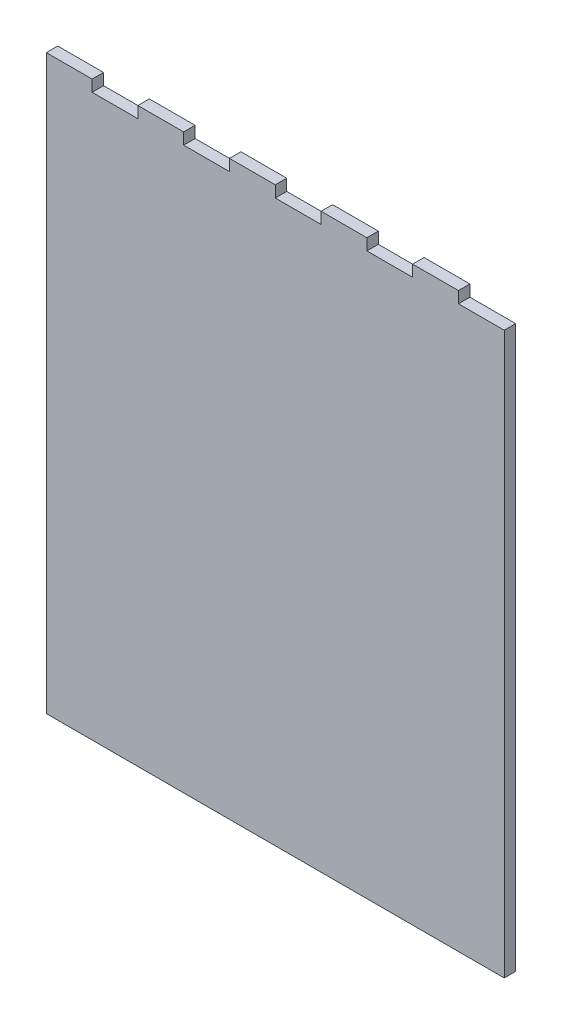
ISO-10303-21;
HEADER;
FILE_DESCRIPTION(('STEP AP214'),'2;1');
FILE_NAME('part.step','',(''),(''),'','','');
FILE_SCHEMA(('AUTOMOTIVE_DESIGN { 1 0 10303 214 1 1 1 1 }'));
ENDSEC;
DATA;
#1=APPLICATION_CONTEXT('core data for automotive mechanical design processes');
#2=APPLICATION_PROTOCOL_DEFINITION('international standard','automotive_design',2000,#1);
#3=PRODUCT_CONTEXT('',#1,'mechanical');
#4=PRODUCT('Part','Part','',(#3));
#5=PRODUCT_RELATED_PRODUCT_CATEGORY('part','',(#4));
#6=PRODUCT_DEFINITION_FORMATION('','',#4);
#7=PRODUCT_DEFINITION_CONTEXT('part definition',#1,'design');
#8=PRODUCT_DEFINITION('design','',#6,#7);
#9=PRODUCT_DEFINITION_SHAPE('','',#8);
#10=(LENGTH_UNIT() NAMED_UNIT(*) SI_UNIT(.MILLI.,.METRE.));
#11=(NAMED_UNIT(*) PLANE_ANGLE_UNIT() SI_UNIT($,.RADIAN.));
#12=(NAMED_UNIT(*) SI_UNIT($,.STERADIAN.) SOLID_ANGLE_UNIT());
#13=UNCERTAINTY_MEASURE_WITH_UNIT(LENGTH_MEASURE(1.E-05),#10,'distance_accuracy_value','');
#14=(GEOMETRIC_REPRESENTATION_CONTEXT(3) GLOBAL_UNCERTAINTY_ASSIGNED_CONTEXT((#13)) GLOBAL_UNIT_ASSIGNED_CONTEXT((#10,
#11,#12)) REPRESENTATION_CONTEXT('',''));
#15=CARTESIAN_POINT('',(0.,0.,0.));
#16=DIRECTION('',(0.,0.,1.));
#17=DIRECTION('',(1.,0.,0.));
#18=AXIS2_PLACEMENT_3D('',#15,#16,#17);
#19=CARTESIAN_POINT('',(0.,317.5,6.35));
#20=DIRECTION('',(0.,-1.,0.));
#21=DIRECTION('',(0.,0.,-1.));
#22=AXIS2_PLACEMENT_3D('',#19,#20,#21);
#23=PLANE('',#22);
#24=DIRECTION('',(0.,0.,-1.));
#25=VECTOR('',#24,1.);
#26=CARTESIAN_POINT('',(76.2,317.5,6.35));
#27=LINE('',#26,#25);
#28=CARTESIAN_POINT('',(76.2,317.5,6.35));
#29=VERTEX_POINT('',#28);
#30=CARTESIAN_POINT('',(76.2,317.5,0.));
#31=VERTEX_POINT('',#30);
#32=EDGE_CURVE('E197',#29,#31,#27,.T.);
#33=ORIENTED_EDGE('',*,*,#32,.T.);
#34=DIRECTION('',(-1.,0.,0.));
#35=VECTOR('',#34,1.);
#36=CARTESIAN_POINT('',(0.,317.5,0.));
#37=LINE('',#36,#35);
#38=CARTESIAN_POINT('',(50.8,317.5,0.));
#39=VERTEX_POINT('',#38);
#40=EDGE_CURVE('E394',#31,#39,#37,.T.);
#41=ORIENTED_EDGE('',*,*,#40,.T.);
#42=DIRECTION('',(0.,0.,-1.));
#43=VECTOR('',#42,1.);
#44=CARTESIAN_POINT('',(50.8,317.5,6.35));
#45=LINE('',#44,#43);
#46=CARTESIAN_POINT('',(50.8,317.5,6.35));
#47=VERTEX_POINT('',#46);
#48=EDGE_CURVE('E354',#47,#39,#45,.T.);
#49=ORIENTED_EDGE('',*,*,#48,.F.);
#50=DIRECTION('',(-1.,0.,0.));
#51=VECTOR('',#50,1.);
#52=CARTESIAN_POINT('',(0.,317.5,6.35));
#53=LINE('',#52,#51);
#54=EDGE_CURVE('E379',#29,#47,#53,.T.);
#55=ORIENTED_EDGE('',*,*,#54,.F.);
#56=EDGE_LOOP('',(#33,#41,#49,#55));
#57=FACE_BOUND('',#56,.T.);
#58=ADVANCED_FACE('F39',(#57),#23,.F.);
#59=DIRECTION('',(0.,0.,-1.));
#60=VECTOR('',#59,1.);
#61=CARTESIAN_POINT('',(101.6,317.5,6.35));
#62=LINE('',#61,#60);
#63=CARTESIAN_POINT('',(101.6,317.5,6.35));
#64=VERTEX_POINT('',#63);
#65=CARTESIAN_POINT('',(101.6,317.5,0.));
#66=VERTEX_POINT('',#65);
#67=EDGE_CURVE('E55',#64,#66,#62,.T.);
#68=ORIENTED_EDGE('',*,*,#67,.F.);
#69=CARTESIAN_POINT('',(127.,317.5,6.35));
#70=VERTEX_POINT('',#69);
#71=EDGE_CURVE('E382',#70,#64,#53,.T.);
#72=ORIENTED_EDGE('',*,*,#71,.F.);
#73=DIRECTION('',(0.,0.,-1.));
#74=VECTOR('',#73,1.);
#75=CARTESIAN_POINT('',(127.,317.5,6.35));
#76=LINE('',#75,#74);
#77=CARTESIAN_POINT('',(127.,317.5,0.));
#78=VERTEX_POINT('',#77);
#79=EDGE_CURVE('E247',#70,#78,#76,.T.);
#80=ORIENTED_EDGE('',*,*,#79,.T.);
#81=EDGE_CURVE('E397',#78,#66,#37,.T.);
#82=ORIENTED_EDGE('',*,*,#81,.T.);
#83=EDGE_LOOP('',(#68,#72,#80,#82));
#84=FACE_BOUND('',#83,.T.);
#85=ADVANCED_FACE('F457',(#84),#23,.F.);
#86=DIRECTION('',(0.,0.,-1.));
#87=VECTOR('',#86,1.);
#88=CARTESIAN_POINT('',(152.4,317.5,6.35));
#89=LINE('',#88,#87);
#90=CARTESIAN_POINT('',(152.4,317.5,6.35));
#91=VERTEX_POINT('',#90);
#92=CARTESIAN_POINT('',(152.4,317.5,0.));
#93=VERTEX_POINT('',#92);
#94=EDGE_CURVE('E63',#91,#93,#89,.T.);
#95=ORIENTED_EDGE('',*,*,#94,.F.);
#96=CARTESIAN_POINT('',(177.8,317.5,6.35));
#97=VERTEX_POINT('',#96);
#98=EDGE_CURVE('E431',#97,#91,#53,.T.);
#99=ORIENTED_EDGE('',*,*,#98,.F.);
#100=DIRECTION('',(0.,0.,-1.));
#101=VECTOR('',#100,1.);
#102=CARTESIAN_POINT('',(177.8,317.5,6.35));
#103=LINE('',#102,#101);
#104=CARTESIAN_POINT('',(177.8,317.5,0.));
#105=VERTEX_POINT('',#104);
#106=EDGE_CURVE('E280',#97,#105,#103,.T.);
#107=ORIENTED_EDGE('',*,*,#106,.T.);
#108=EDGE_CURVE('E482',#105,#93,#37,.T.);
#109=ORIENTED_EDGE('',*,*,#108,.T.);
#110=EDGE_LOOP('',(#95,#99,#107,#109));
#111=FACE_BOUND('',#110,.T.);
#112=ADVANCED_FACE('F463',(#111),#23,.F.);
#113=DIRECTION('',(0.,0.,-1.));
#114=VECTOR('',#113,1.);
#115=CARTESIAN_POINT('',(203.2,317.5,6.35));
#116=LINE('',#115,#114);
#117=CARTESIAN_POINT('',(203.2,317.5,6.35));
#118=VERTEX_POINT('',#117);
#119=CARTESIAN_POINT('',(203.2,317.5,0.));
#120=VERTEX_POINT('',#119);
#121=EDGE_CURVE('E296',#118,#120,#116,.T.);
#122=ORIENTED_EDGE('',*,*,#121,.F.);
#123=CARTESIAN_POINT('',(228.6,317.5,6.35));
#124=VERTEX_POINT('',#123);
#125=EDGE_CURVE('E401',#124,#118,#53,.T.);
#126=ORIENTED_EDGE('',*,*,#125,.F.);
#127=DIRECTION('',(0.,0.,-1.));
#128=VECTOR('',#127,1.);
#129=CARTESIAN_POINT('',(228.6,317.5,6.35));
#130=LINE('',#129,#128);
#131=CARTESIAN_POINT('',(228.6,317.5,0.));
#132=VERTEX_POINT('',#131);
#133=EDGE_CURVE('E312',#124,#132,#130,.T.);
#134=ORIENTED_EDGE('',*,*,#133,.T.);
#135=EDGE_CURVE('E371',#132,#120,#37,.T.);
#136=ORIENTED_EDGE('',*,*,#135,.T.);
#137=EDGE_LOOP('',(#122,#126,#134,#136));
#138=FACE_BOUND('',#137,.T.);
#139=ADVANCED_FACE('F428',(#138),#23,.F.);
#140=CARTESIAN_POINT('',(0.,0.,6.35));
#141=DIRECTION('',(0.,0.,-1.));
#142=DIRECTION('',(-1.,0.,0.));
#143=AXIS2_PLACEMENT_3D('',#140,#141,#142);
#144=PLANE('',#143);
#145=DIRECTION('',(0.,-1.,0.));
#146=VECTOR('',#145,1.);
#147=CARTESIAN_POINT('',(76.2,317.5,6.35));
#148=LINE('',#147,#146);
#149=CARTESIAN_POINT('',(76.2,311.15,6.35));
#150=VERTEX_POINT('',#149);
#151=EDGE_CURVE('E191',#29,#150,#148,.T.);
#152=ORIENTED_EDGE('',*,*,#151,.F.);
#153=ORIENTED_EDGE('',*,*,#54,.T.);
#154=DIRECTION('',(0.,1.,0.));
#155=VECTOR('',#154,1.);
#156=CARTESIAN_POINT('',(50.8,317.5,6.35));
#157=LINE('',#156,#155);
#158=CARTESIAN_POINT('',(50.8,311.15,6.35));
#159=VERTEX_POINT('',#158);
#160=EDGE_CURVE('E336',#159,#47,#157,.T.);
#161=ORIENTED_EDGE('',*,*,#160,.F.);
#162=DIRECTION('',(1.,0.,0.));
#163=VECTOR('',#162,1.);
#164=CARTESIAN_POINT('',(25.4,311.15,6.35));
#165=LINE('',#164,#163);
#166=CARTESIAN_POINT('',(25.4,311.15,6.35));
#167=VERTEX_POINT('',#166);
#168=EDGE_CURVE('E332',#167,#159,#165,.T.);
#169=ORIENTED_EDGE('',*,*,#168,.F.);
#170=DIRECTION('',(0.,-1.,0.));
#171=VECTOR('',#170,1.);
#172=CARTESIAN_POINT('',(25.4,317.5,6.35));
#173=LINE('',#172,#171);
#174=CARTESIAN_POINT('',(25.4,317.5,6.35));
#175=VERTEX_POINT('',#174);
#176=EDGE_CURVE('E329',#175,#167,#173,.T.);
#177=ORIENTED_EDGE('',*,*,#176,.F.);
#178=CARTESIAN_POINT('',(0.,317.5,6.35));
#179=VERTEX_POINT('',#178);
#180=EDGE_CURVE('E378',#175,#179,#53,.T.);
#181=ORIENTED_EDGE('',*,*,#180,.T.);
#182=DIRECTION('',(0.,-1.,0.));
#183=VECTOR('',#182,1.);
#184=CARTESIAN_POINT('',(0.,0.,6.35));
#185=LINE('',#184,#183);
#186=CARTESIAN_POINT('',(0.,0.,6.35));
#187=VERTEX_POINT('',#186);
#188=EDGE_CURVE('E366',#179,#187,#185,.T.);
#189=ORIENTED_EDGE('',*,*,#188,.T.);
#190=DIRECTION('',(1.,0.,0.));
#191=VECTOR('',#190,1.);
#192=CARTESIAN_POINT('',(0.,0.,6.35));
#193=LINE('',#192,#191);
#194=CARTESIAN_POINT('',(254.,0.,6.35));
#195=VERTEX_POINT('',#194);
#196=EDGE_CURVE('E370',#187,#195,#193,.T.);
#197=ORIENTED_EDGE('',*,*,#196,.T.);
#198=DIRECTION('',(0.,1.,0.));
#199=VECTOR('',#198,1.);
#200=CARTESIAN_POINT('',(254.,0.,6.35));
#201=LINE('',#200,#199);
#202=CARTESIAN_POINT('',(254.,311.15,6.35));
#203=VERTEX_POINT('',#202);
#204=EDGE_CURVE('E374',#195,#203,#201,.T.);
#205=ORIENTED_EDGE('',*,*,#204,.T.);
#206=DIRECTION('',(1.,0.,0.));
#207=VECTOR('',#206,1.);
#208=CARTESIAN_POINT('',(228.6,311.15,6.35));
#209=LINE('',#208,#207);
#210=CARTESIAN_POINT('',(228.6,311.15,6.35));
#211=VERTEX_POINT('',#210);
#212=EDGE_CURVE('E308',#211,#203,#209,.T.);
#213=ORIENTED_EDGE('',*,*,#212,.F.);
#214=DIRECTION('',(0.,-1.,0.));
#215=VECTOR('',#214,1.);
#216=CARTESIAN_POINT('',(228.6,317.5,6.35));
#217=LINE('',#216,#215);
#218=EDGE_CURVE('E305',#124,#211,#217,.T.);
#219=ORIENTED_EDGE('',*,*,#218,.F.);
#220=ORIENTED_EDGE('',*,*,#125,.T.);
#221=DIRECTION('',(0.,1.,0.));
#222=VECTOR('',#221,1.);
#223=CARTESIAN_POINT('',(203.2,317.5,6.35));
#224=LINE('',#223,#222);
#225=CARTESIAN_POINT('',(203.2,311.15,6.35));
#226=VERTEX_POINT('',#225);
#227=EDGE_CURVE('E277',#226,#118,#224,.T.);
#228=ORIENTED_EDGE('',*,*,#227,.F.);
#229=DIRECTION('',(1.,0.,0.));
#230=VECTOR('',#229,1.);
#231=CARTESIAN_POINT('',(177.8,311.15,6.35));
#232=LINE('',#231,#230);
#233=CARTESIAN_POINT('',(177.8,311.15,6.35));
#234=VERTEX_POINT('',#233);
#235=EDGE_CURVE('E273',#234,#226,#232,.T.);
#236=ORIENTED_EDGE('',*,*,#235,.F.);
#237=DIRECTION('',(0.,-1.,0.));
#238=VECTOR('',#237,1.);
#239=CARTESIAN_POINT('',(177.8,317.5,6.35));
#240=LINE('',#239,#238);
#241=EDGE_CURVE('E270',#97,#234,#240,.T.);
#242=ORIENTED_EDGE('',*,*,#241,.F.);
#243=ORIENTED_EDGE('',*,*,#98,.T.);
#244=DIRECTION('',(0.,1.,0.));
#245=VECTOR('',#244,1.);
#246=CARTESIAN_POINT('',(152.4,317.5,6.35));
#247=LINE('',#246,#245);
#248=CARTESIAN_POINT('',(152.4,311.15,6.35));
#249=VERTEX_POINT('',#248);
#250=EDGE_CURVE('E244',#249,#91,#247,.T.);
#251=ORIENTED_EDGE('',*,*,#250,.F.);
#252=DIRECTION('',(1.,0.,0.));
#253=VECTOR('',#252,1.);
#254=CARTESIAN_POINT('',(127.,311.15,6.35));
#255=LINE('',#254,#253);
#256=CARTESIAN_POINT('',(127.,311.15,6.35));
#257=VERTEX_POINT('',#256);
#258=EDGE_CURVE('E240',#257,#249,#255,.T.);
#259=ORIENTED_EDGE('',*,*,#258,.F.);
#260=DIRECTION('',(0.,-1.,0.));
#261=VECTOR('',#260,1.);
#262=CARTESIAN_POINT('',(127.,317.5,6.35));
#263=LINE('',#262,#261);
#264=EDGE_CURVE('E237',#70,#257,#263,.T.);
#265=ORIENTED_EDGE('',*,*,#264,.F.);
#266=ORIENTED_EDGE('',*,*,#71,.T.);
#267=DIRECTION('',(0.,1.,0.));
#268=VECTOR('',#267,1.);
#269=CARTESIAN_POINT('',(101.6,317.5,6.35));
#270=LINE('',#269,#268);
#271=CARTESIAN_POINT('',(101.6,311.15,6.35));
#272=VERTEX_POINT('',#271);
#273=EDGE_CURVE('E217',#272,#64,#270,.T.);
#274=ORIENTED_EDGE('',*,*,#273,.F.);
#275=DIRECTION('',(1.,0.,0.));
#276=VECTOR('',#275,1.);
#277=CARTESIAN_POINT('',(76.2,311.15,6.35));
#278=LINE('',#277,#276);
#279=EDGE_CURVE('E202',#150,#272,#278,.T.);
#280=ORIENTED_EDGE('',*,*,#279,.F.);
#281=EDGE_LOOP('',(#152,#153,#161,#169,#177,#181,#189,#197,#205,#213,#219,#220,#228,#236,#242,
#243,#251,#259,#265,#266,#274,#280));
#282=FACE_BOUND('',#281,.T.);
#283=ADVANCED_FACE('F215',(#282),#144,.F.);
#284=CARTESIAN_POINT('',(0.,0.,0.));
#285=DIRECTION('',(0.,0.,-1.));
#286=DIRECTION('',(-1.,0.,0.));
#287=AXIS2_PLACEMENT_3D('',#284,#285,#286);
#288=PLANE('',#287);
#289=ORIENTED_EDGE('',*,*,#40,.F.);
#290=DIRECTION('',(0.,-1.,0.));
#291=VECTOR('',#290,1.);
#292=CARTESIAN_POINT('',(76.2,317.5,0.));
#293=LINE('',#292,#291);
#294=CARTESIAN_POINT('',(76.2,311.15,0.));
#295=VERTEX_POINT('',#294);
#296=EDGE_CURVE('E223',#31,#295,#293,.T.);
#297=ORIENTED_EDGE('',*,*,#296,.T.);
#298=DIRECTION('',(1.,0.,0.));
#299=VECTOR('',#298,1.);
#300=CARTESIAN_POINT('',(76.2,311.15,0.));
#301=LINE('',#300,#299);
#302=CARTESIAN_POINT('',(101.6,311.15,0.));
#303=VERTEX_POINT('',#302);
#304=EDGE_CURVE('E209',#295,#303,#301,.T.);
#305=ORIENTED_EDGE('',*,*,#304,.T.);
#306=DIRECTION('',(0.,1.,0.));
#307=VECTOR('',#306,1.);
#308=CARTESIAN_POINT('',(101.6,317.5,0.));
#309=LINE('',#308,#307);
#310=EDGE_CURVE('E203',#303,#66,#309,.T.);
#311=ORIENTED_EDGE('',*,*,#310,.T.);
#312=ORIENTED_EDGE('',*,*,#81,.F.);
#313=DIRECTION('',(0.,-1.,0.));
#314=VECTOR('',#313,1.);
#315=CARTESIAN_POINT('',(127.,317.5,0.));
#316=LINE('',#315,#314);
#317=CARTESIAN_POINT('',(127.,311.15,0.));
#318=VERTEX_POINT('',#317);
#319=EDGE_CURVE('E248',#78,#318,#316,.T.);
#320=ORIENTED_EDGE('',*,*,#319,.T.);
#321=DIRECTION('',(1.,0.,0.));
#322=VECTOR('',#321,1.);
#323=CARTESIAN_POINT('',(127.,311.15,0.));
#324=LINE('',#323,#322);
#325=CARTESIAN_POINT('',(152.4,311.15,0.));
#326=VERTEX_POINT('',#325);
#327=EDGE_CURVE('E252',#318,#326,#324,.T.);
#328=ORIENTED_EDGE('',*,*,#327,.T.);
#329=DIRECTION('',(0.,1.,0.));
#330=VECTOR('',#329,1.);
#331=CARTESIAN_POINT('',(152.4,317.5,0.));
#332=LINE('',#331,#330);
#333=EDGE_CURVE('E241',#326,#93,#332,.T.);
#334=ORIENTED_EDGE('',*,*,#333,.T.);
#335=ORIENTED_EDGE('',*,*,#108,.F.);
#336=DIRECTION('',(0.,-1.,0.));
#337=VECTOR('',#336,1.);
#338=CARTESIAN_POINT('',(177.8,317.5,0.));
#339=LINE('',#338,#337);
#340=CARTESIAN_POINT('',(177.8,311.15,0.));
#341=VERTEX_POINT('',#340);
#342=EDGE_CURVE('E281',#105,#341,#339,.T.);
#343=ORIENTED_EDGE('',*,*,#342,.T.);
#344=DIRECTION('',(1.,0.,0.));
#345=VECTOR('',#344,1.);
#346=CARTESIAN_POINT('',(177.8,311.15,0.));
#347=LINE('',#346,#345);
#348=CARTESIAN_POINT('',(203.2,311.15,0.));
#349=VERTEX_POINT('',#348);
#350=EDGE_CURVE('E285',#341,#349,#347,.T.);
#351=ORIENTED_EDGE('',*,*,#350,.T.);
#352=DIRECTION('',(0.,1.,0.));
#353=VECTOR('',#352,1.);
#354=CARTESIAN_POINT('',(203.2,317.5,0.));
#355=LINE('',#354,#353);
#356=EDGE_CURVE('E274',#349,#120,#355,.T.);
#357=ORIENTED_EDGE('',*,*,#356,.T.);
#358=ORIENTED_EDGE('',*,*,#135,.F.);
#359=DIRECTION('',(0.,-1.,0.));
#360=VECTOR('',#359,1.);
#361=CARTESIAN_POINT('',(228.6,317.5,0.));
#362=LINE('',#361,#360);
#363=CARTESIAN_POINT('',(228.6,311.15,0.));
#364=VERTEX_POINT('',#363);
#365=EDGE_CURVE('E313',#132,#364,#362,.T.);
#366=ORIENTED_EDGE('',*,*,#365,.T.);
#367=DIRECTION('',(1.,0.,0.));
#368=VECTOR('',#367,1.);
#369=CARTESIAN_POINT('',(228.6,311.15,0.));
#370=LINE('',#369,#368);
#371=CARTESIAN_POINT('',(254.,311.15,0.));
#372=VERTEX_POINT('',#371);
#373=EDGE_CURVE('E309',#364,#372,#370,.T.);
#374=ORIENTED_EDGE('',*,*,#373,.T.);
#375=DIRECTION('',(0.,1.,0.));
#376=VECTOR('',#375,1.);
#377=CARTESIAN_POINT('',(254.,0.,0.));
#378=LINE('',#377,#376);
#379=CARTESIAN_POINT('',(254.,0.,0.));
#380=VERTEX_POINT('',#379);
#381=EDGE_CURVE('E389',#380,#372,#378,.T.);
#382=ORIENTED_EDGE('',*,*,#381,.F.);
#383=DIRECTION('',(1.,0.,0.));
#384=VECTOR('',#383,1.);
#385=CARTESIAN_POINT('',(0.,0.,0.));
#386=LINE('',#385,#384);
#387=CARTESIAN_POINT('',(0.,0.,0.));
#388=VERTEX_POINT('',#387);
#389=EDGE_CURVE('E386',#388,#380,#386,.T.);
#390=ORIENTED_EDGE('',*,*,#389,.F.);
#391=DIRECTION('',(0.,-1.,0.));
#392=VECTOR('',#391,1.);
#393=CARTESIAN_POINT('',(0.,0.,0.));
#394=LINE('',#393,#392);
#395=CARTESIAN_POINT('',(0.,317.5,0.));
#396=VERTEX_POINT('',#395);
#397=EDGE_CURVE('E365',#396,#388,#394,.T.);
#398=ORIENTED_EDGE('',*,*,#397,.F.);
#399=CARTESIAN_POINT('',(25.4,317.5,0.));
#400=VERTEX_POINT('',#399);
#401=EDGE_CURVE('E393',#400,#396,#37,.T.);
#402=ORIENTED_EDGE('',*,*,#401,.F.);
#403=DIRECTION('',(0.,-1.,0.));
#404=VECTOR('',#403,1.);
#405=CARTESIAN_POINT('',(25.4,317.5,0.));
#406=LINE('',#405,#404);
#407=CARTESIAN_POINT('',(25.4,311.15,0.));
#408=VERTEX_POINT('',#407);
#409=EDGE_CURVE('E211',#400,#408,#406,.T.);
#410=ORIENTED_EDGE('',*,*,#409,.T.);
#411=DIRECTION('',(1.,0.,0.));
#412=VECTOR('',#411,1.);
#413=CARTESIAN_POINT('',(25.4,311.15,0.));
#414=LINE('',#413,#412);
#415=CARTESIAN_POINT('',(50.8,311.15,0.));
#416=VERTEX_POINT('',#415);
#417=EDGE_CURVE('E344',#408,#416,#414,.T.);
#418=ORIENTED_EDGE('',*,*,#417,.T.);
#419=DIRECTION('',(0.,1.,0.));
#420=VECTOR('',#419,1.);
#421=CARTESIAN_POINT('',(50.8,317.5,0.));
#422=LINE('',#421,#420);
#423=EDGE_CURVE('E333',#416,#39,#422,.T.);
#424=ORIENTED_EDGE('',*,*,#423,.T.);
#425=EDGE_LOOP('',(#289,#297,#305,#311,#312,#320,#328,#334,#335,#343,#351,#357,#358,#366,#374,
#382,#390,#398,#402,#410,#418,#424));
#426=FACE_BOUND('',#425,.T.);
#427=ADVANCED_FACE('F413',(#426),#288,.T.);
#428=CARTESIAN_POINT('',(254.,0.,6.35));
#429=DIRECTION('',(-1.,0.,0.));
#430=DIRECTION('',(0.,0.,1.));
#431=AXIS2_PLACEMENT_3D('',#428,#429,#430);
#432=PLANE('',#431);
#433=DIRECTION('',(0.,0.,-1.));
#434=VECTOR('',#433,1.);
#435=CARTESIAN_POINT('',(254.,311.15,6.35));
#436=LINE('',#435,#434);
#437=EDGE_CURVE('E323',#203,#372,#436,.T.);
#438=ORIENTED_EDGE('',*,*,#437,.F.);
#439=ORIENTED_EDGE('',*,*,#204,.F.);
#440=DIRECTION('',(0.,0.,-1.));
#441=VECTOR('',#440,1.);
#442=CARTESIAN_POINT('',(254.,0.,6.35));
#443=LINE('',#442,#441);
#444=EDGE_CURVE('E48',#195,#380,#443,.T.);
#445=ORIENTED_EDGE('',*,*,#444,.T.);
#446=ORIENTED_EDGE('',*,*,#381,.T.);
#447=EDGE_LOOP('',(#438,#439,#445,#446));
#448=FACE_BOUND('',#447,.T.);
#449=ADVANCED_FACE('F409',(#448),#432,.F.);
#450=DIRECTION('',(0.,0.,-1.));
#451=VECTOR('',#450,1.);
#452=CARTESIAN_POINT('',(25.4,317.5,6.35));
#453=LINE('',#452,#451);
#454=EDGE_CURVE('E340',#175,#400,#453,.T.);
#455=ORIENTED_EDGE('',*,*,#454,.T.);
#456=ORIENTED_EDGE('',*,*,#401,.T.);
#457=DIRECTION('',(0.,0.,-1.));
#458=VECTOR('',#457,1.);
#459=CARTESIAN_POINT('',(0.,317.5,6.35));
#460=LINE('',#459,#458);
#461=EDGE_CURVE('E398',#179,#396,#460,.T.);
#462=ORIENTED_EDGE('',*,*,#461,.F.);
#463=ORIENTED_EDGE('',*,*,#180,.F.);
#464=EDGE_LOOP('',(#455,#456,#462,#463));
#465=FACE_BOUND('',#464,.T.);
#466=ADVANCED_FACE('F442',(#465),#23,.F.);
#467=CARTESIAN_POINT('',(0.,0.,6.35));
#468=DIRECTION('',(1.,0.,0.));
#469=DIRECTION('',(0.,0.,-1.));
#470=AXIS2_PLACEMENT_3D('',#467,#468,#469);
#471=PLANE('',#470);
#472=ORIENTED_EDGE('',*,*,#397,.T.);
#473=DIRECTION('',(0.,0.,-1.));
#474=VECTOR('',#473,1.);
#475=CARTESIAN_POINT('',(0.,0.,6.35));
#476=LINE('',#475,#474);
#477=EDGE_CURVE('E11',#187,#388,#476,.T.);
#478=ORIENTED_EDGE('',*,*,#477,.F.);
#479=ORIENTED_EDGE('',*,*,#188,.F.);
#480=ORIENTED_EDGE('',*,*,#461,.T.);
#481=EDGE_LOOP('',(#472,#478,#479,#480));
#482=FACE_BOUND('',#481,.T.);
#483=ADVANCED_FACE('F41',(#482),#471,.F.);
#484=CARTESIAN_POINT('',(0.,0.,6.35));
#485=DIRECTION('',(0.,1.,0.));
#486=DIRECTION('',(0.,0.,1.));
#487=AXIS2_PLACEMENT_3D('',#484,#485,#486);
#488=PLANE('',#487);
#489=ORIENTED_EDGE('',*,*,#389,.T.);
#490=ORIENTED_EDGE('',*,*,#444,.F.);
#491=ORIENTED_EDGE('',*,*,#196,.F.);
#492=ORIENTED_EDGE('',*,*,#477,.T.);
#493=EDGE_LOOP('',(#489,#490,#491,#492));
#494=FACE_BOUND('',#493,.T.);
#495=ADVANCED_FACE('F445',(#494),#488,.F.);
#496=CARTESIAN_POINT('',(25.4,317.5,6.35));
#497=DIRECTION('',(1.,0.,0.));
#498=DIRECTION('',(0.,1.,0.));
#499=AXIS2_PLACEMENT_3D('',#496,#497,#498);
#500=PLANE('',#499);
#501=ORIENTED_EDGE('',*,*,#409,.F.);
#502=ORIENTED_EDGE('',*,*,#454,.F.);
#503=ORIENTED_EDGE('',*,*,#176,.T.);
#504=DIRECTION('',(0.,0.,-1.));
#505=VECTOR('',#504,1.);
#506=CARTESIAN_POINT('',(25.4,311.15,6.35));
#507=LINE('',#506,#505);
#508=EDGE_CURVE('E361',#167,#408,#507,.T.);
#509=ORIENTED_EDGE('',*,*,#508,.T.);
#510=EDGE_LOOP('',(#501,#502,#503,#509));
#511=FACE_BOUND('',#510,.T.);
#512=ADVANCED_FACE('F447',(#511),#500,.T.);
#513=CARTESIAN_POINT('',(25.4,311.15,6.35));
#514=DIRECTION('',(0.,1.,0.));
#515=DIRECTION('',(0.,0.,1.));
#516=AXIS2_PLACEMENT_3D('',#513,#514,#515);
#517=PLANE('',#516);
#518=ORIENTED_EDGE('',*,*,#417,.F.);
#519=ORIENTED_EDGE('',*,*,#508,.F.);
#520=ORIENTED_EDGE('',*,*,#168,.T.);
#521=DIRECTION('',(0.,0.,-1.));
#522=VECTOR('',#521,1.);
#523=CARTESIAN_POINT('',(50.8,311.15,6.35));
#524=LINE('',#523,#522);
#525=EDGE_CURVE('E358',#159,#416,#524,.T.);
#526=ORIENTED_EDGE('',*,*,#525,.T.);
#527=EDGE_LOOP('',(#518,#519,#520,#526));
#528=FACE_BOUND('',#527,.T.);
#529=ADVANCED_FACE('F452',(#528),#517,.T.);
#530=CARTESIAN_POINT('',(50.8,317.5,6.35));
#531=DIRECTION('',(-1.,0.,0.));
#532=DIRECTION('',(0.,-1.,0.));
#533=AXIS2_PLACEMENT_3D('',#530,#531,#532);
#534=PLANE('',#533);
#535=ORIENTED_EDGE('',*,*,#423,.F.);
#536=ORIENTED_EDGE('',*,*,#525,.F.);
#537=ORIENTED_EDGE('',*,*,#160,.T.);
#538=ORIENTED_EDGE('',*,*,#48,.T.);
#539=EDGE_LOOP('',(#535,#536,#537,#538));
#540=FACE_BOUND('',#539,.T.);
#541=ADVANCED_FACE('F533',(#540),#534,.T.);
#542=CARTESIAN_POINT('',(228.6,317.5,6.35));
#543=DIRECTION('',(1.,0.,0.));
#544=DIRECTION('',(0.,1.,0.));
#545=AXIS2_PLACEMENT_3D('',#542,#543,#544);
#546=PLANE('',#545);
#547=ORIENTED_EDGE('',*,*,#365,.F.);
#548=ORIENTED_EDGE('',*,*,#133,.F.);
#549=ORIENTED_EDGE('',*,*,#218,.T.);
#550=DIRECTION('',(0.,0.,-1.));
#551=VECTOR('',#550,1.);
#552=CARTESIAN_POINT('',(228.6,311.15,6.35));
#553=LINE('',#552,#551);
#554=EDGE_CURVE('E286',#211,#364,#553,.T.);
#555=ORIENTED_EDGE('',*,*,#554,.T.);
#556=EDGE_LOOP('',(#547,#548,#549,#555));
#557=FACE_BOUND('',#556,.T.);
#558=ADVANCED_FACE('F421',(#557),#546,.T.);
#559=CARTESIAN_POINT('',(228.6,311.15,6.35));
#560=DIRECTION('',(0.,1.,0.));
#561=DIRECTION('',(0.,0.,1.));
#562=AXIS2_PLACEMENT_3D('',#559,#560,#561);
#563=PLANE('',#562);
#564=ORIENTED_EDGE('',*,*,#373,.F.);
#565=ORIENTED_EDGE('',*,*,#554,.F.);
#566=ORIENTED_EDGE('',*,*,#212,.T.);
#567=ORIENTED_EDGE('',*,*,#437,.T.);
#568=EDGE_LOOP('',(#564,#565,#566,#567));
#569=FACE_BOUND('',#568,.T.);
#570=ADVANCED_FACE('F418',(#569),#563,.T.);
#571=CARTESIAN_POINT('',(177.8,317.5,6.35));
#572=DIRECTION('',(1.,0.,0.));
#573=DIRECTION('',(0.,1.,0.));
#574=AXIS2_PLACEMENT_3D('',#571,#572,#573);
#575=PLANE('',#574);
#576=ORIENTED_EDGE('',*,*,#342,.F.);
#577=ORIENTED_EDGE('',*,*,#106,.F.);
#578=ORIENTED_EDGE('',*,*,#241,.T.);
#579=DIRECTION('',(0.,0.,-1.));
#580=VECTOR('',#579,1.);
#581=CARTESIAN_POINT('',(177.8,311.15,6.35));
#582=LINE('',#581,#580);
#583=EDGE_CURVE('E253',#234,#341,#582,.T.);
#584=ORIENTED_EDGE('',*,*,#583,.T.);
#585=EDGE_LOOP('',(#576,#577,#578,#584));
#586=FACE_BOUND('',#585,.T.);
#587=ADVANCED_FACE('F489',(#586),#575,.T.);
#588=CARTESIAN_POINT('',(177.8,311.15,6.35));
#589=DIRECTION('',(0.,1.,0.));
#590=DIRECTION('',(0.,0.,1.));
#591=AXIS2_PLACEMENT_3D('',#588,#589,#590);
#592=PLANE('',#591);
#593=ORIENTED_EDGE('',*,*,#350,.F.);
#594=ORIENTED_EDGE('',*,*,#583,.F.);
#595=ORIENTED_EDGE('',*,*,#235,.T.);
#596=DIRECTION('',(0.,0.,-1.));
#597=VECTOR('',#596,1.);
#598=CARTESIAN_POINT('',(203.2,311.15,6.35));
#599=LINE('',#598,#597);
#600=EDGE_CURVE('E299',#226,#349,#599,.T.);
#601=ORIENTED_EDGE('',*,*,#600,.T.);
#602=EDGE_LOOP('',(#593,#594,#595,#601));
#603=FACE_BOUND('',#602,.T.);
#604=ADVANCED_FACE('F491',(#603),#592,.T.);
#605=CARTESIAN_POINT('',(203.2,317.5,6.35));
#606=DIRECTION('',(-1.,0.,0.));
#607=DIRECTION('',(0.,-1.,0.));
#608=AXIS2_PLACEMENT_3D('',#605,#606,#607);
#609=PLANE('',#608);
#610=ORIENTED_EDGE('',*,*,#356,.F.);
#611=ORIENTED_EDGE('',*,*,#600,.F.);
#612=ORIENTED_EDGE('',*,*,#227,.T.);
#613=ORIENTED_EDGE('',*,*,#121,.T.);
#614=EDGE_LOOP('',(#610,#611,#612,#613));
#615=FACE_BOUND('',#614,.T.);
#616=ADVANCED_FACE('F520',(#615),#609,.T.);
#617=CARTESIAN_POINT('',(127.,317.5,6.35));
#618=DIRECTION('',(1.,0.,0.));
#619=DIRECTION('',(0.,1.,0.));
#620=AXIS2_PLACEMENT_3D('',#617,#618,#619);
#621=PLANE('',#620);
#622=ORIENTED_EDGE('',*,*,#319,.F.);
#623=ORIENTED_EDGE('',*,*,#79,.F.);
#624=ORIENTED_EDGE('',*,*,#264,.T.);
#625=DIRECTION('',(0.,0.,-1.));
#626=VECTOR('',#625,1.);
#627=CARTESIAN_POINT('',(127.,311.15,6.35));
#628=LINE('',#627,#626);
#629=EDGE_CURVE('E226',#257,#318,#628,.T.);
#630=ORIENTED_EDGE('',*,*,#629,.T.);
#631=EDGE_LOOP('',(#622,#623,#624,#630));
#632=FACE_BOUND('',#631,.T.);
#633=ADVANCED_FACE('F516',(#632),#621,.T.);
#634=CARTESIAN_POINT('',(127.,311.15,6.35));
#635=DIRECTION('',(0.,1.,0.));
#636=DIRECTION('',(0.,0.,1.));
#637=AXIS2_PLACEMENT_3D('',#634,#635,#636);
#638=PLANE('',#637);
#639=ORIENTED_EDGE('',*,*,#327,.F.);
#640=ORIENTED_EDGE('',*,*,#629,.F.);
#641=ORIENTED_EDGE('',*,*,#258,.T.);
#642=DIRECTION('',(0.,0.,-1.));
#643=VECTOR('',#642,1.);
#644=CARTESIAN_POINT('',(152.4,311.15,6.35));
#645=LINE('',#644,#643);
#646=EDGE_CURVE('E264',#249,#326,#645,.T.);
#647=ORIENTED_EDGE('',*,*,#646,.T.);
#648=EDGE_LOOP('',(#639,#640,#641,#647));
#649=FACE_BOUND('',#648,.T.);
#650=ADVANCED_FACE('F513',(#649),#638,.T.);
#651=CARTESIAN_POINT('',(152.4,317.5,6.35));
#652=DIRECTION('',(-1.,0.,0.));
#653=DIRECTION('',(0.,-1.,0.));
#654=AXIS2_PLACEMENT_3D('',#651,#652,#653);
#655=PLANE('',#654);
#656=ORIENTED_EDGE('',*,*,#333,.F.);
#657=ORIENTED_EDGE('',*,*,#646,.F.);
#658=ORIENTED_EDGE('',*,*,#250,.T.);
#659=ORIENTED_EDGE('',*,*,#94,.T.);
#660=EDGE_LOOP('',(#656,#657,#658,#659));
#661=FACE_BOUND('',#660,.T.);
#662=ADVANCED_FACE('F510',(#661),#655,.T.);
#663=CARTESIAN_POINT('',(76.2,317.5,6.35));
#664=DIRECTION('',(1.,0.,0.));
#665=DIRECTION('',(0.,1.,0.));
#666=AXIS2_PLACEMENT_3D('',#663,#664,#665);
#667=PLANE('',#666);
#668=ORIENTED_EDGE('',*,*,#296,.F.);
#669=ORIENTED_EDGE('',*,*,#32,.F.);
#670=ORIENTED_EDGE('',*,*,#151,.T.);
#671=DIRECTION('',(0.,0.,-1.));
#672=VECTOR('',#671,1.);
#673=CARTESIAN_POINT('',(76.2,311.15,6.35));
#674=LINE('',#673,#672);
#675=EDGE_CURVE('E194',#150,#295,#674,.T.);
#676=ORIENTED_EDGE('',*,*,#675,.T.);
#677=EDGE_LOOP('',(#668,#669,#670,#676));
#678=FACE_BOUND('',#677,.T.);
#679=ADVANCED_FACE('F193',(#678),#667,.T.);
#680=CARTESIAN_POINT('',(76.2,311.15,6.35));
#681=DIRECTION('',(0.,1.,0.));
#682=DIRECTION('',(0.,0.,1.));
#683=AXIS2_PLACEMENT_3D('',#680,#681,#682);
#684=PLANE('',#683);
#685=ORIENTED_EDGE('',*,*,#304,.F.);
#686=ORIENTED_EDGE('',*,*,#675,.F.);
#687=ORIENTED_EDGE('',*,*,#279,.T.);
#688=DIRECTION('',(0.,0.,-1.));
#689=VECTOR('',#688,1.);
#690=CARTESIAN_POINT('',(101.6,311.15,6.35));
#691=LINE('',#690,#689);
#692=EDGE_CURVE('E212',#272,#303,#691,.T.);
#693=ORIENTED_EDGE('',*,*,#692,.T.);
#694=EDGE_LOOP('',(#685,#686,#687,#693));
#695=FACE_BOUND('',#694,.T.);
#696=ADVANCED_FACE('F206',(#695),#684,.T.);
#697=CARTESIAN_POINT('',(101.6,317.5,6.35));
#698=DIRECTION('',(-1.,0.,0.));
#699=DIRECTION('',(0.,-1.,0.));
#700=AXIS2_PLACEMENT_3D('',#697,#698,#699);
#701=PLANE('',#700);
#702=ORIENTED_EDGE('',*,*,#310,.F.);
#703=ORIENTED_EDGE('',*,*,#692,.F.);
#704=ORIENTED_EDGE('',*,*,#273,.T.);
#705=ORIENTED_EDGE('',*,*,#67,.T.);
#706=EDGE_LOOP('',(#702,#703,#704,#705));
#707=FACE_BOUND('',#706,.T.);
#708=ADVANCED_FACE('F500',(#707),#701,.T.);
#709=CLOSED_SHELL('',(#58,#85,#112,#139,#283,#427,#449,#466,#483,#495,#512,#529,#541,#558,#570,
#587,#604,#616,#633,#650,#662,#679,#696,#708));
#710=MANIFOLD_SOLID_BREP('B2',#709);
#711=ADVANCED_BREP_SHAPE_REPRESENTATION('',(#18,#710),#14);
#712=SHAPE_DEFINITION_REPRESENTATION(#9,#711);
ENDSEC;
END-ISO-10303-21;
